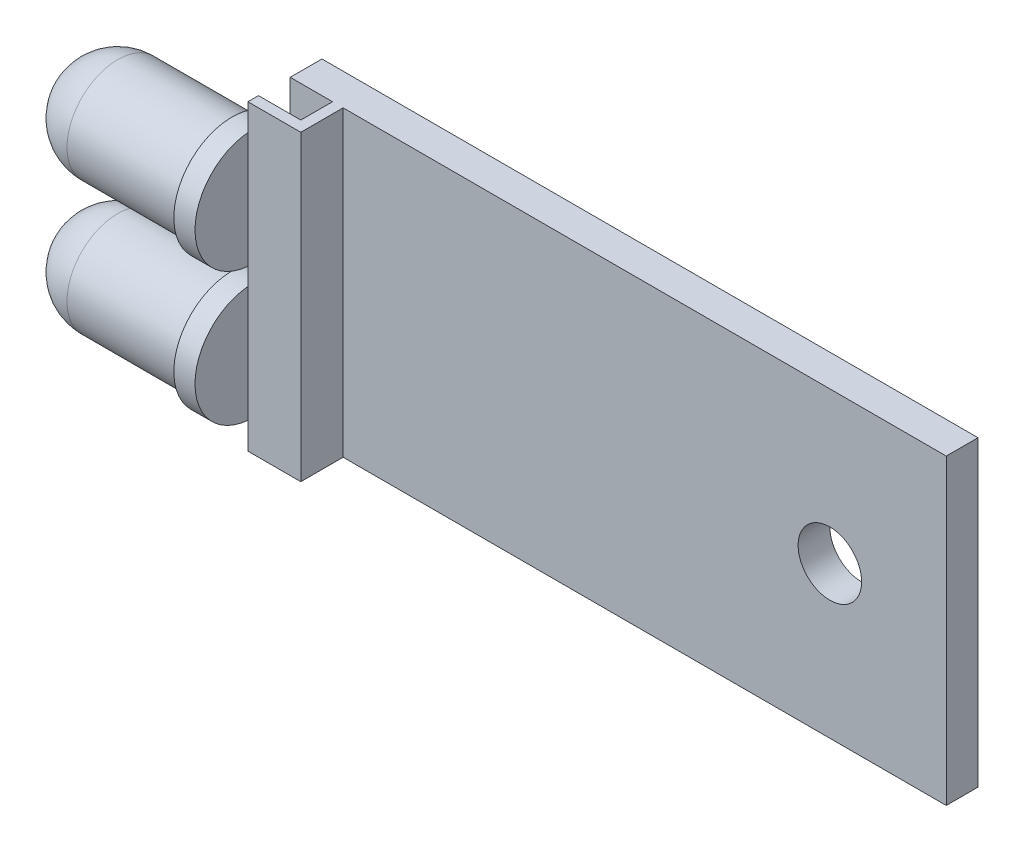
ISO-10303-21;
HEADER;
FILE_DESCRIPTION(('STEP AP214'),'2;1');
FILE_NAME('part.step','',(''),(''),'','','');
FILE_SCHEMA(('AUTOMOTIVE_DESIGN { 1 0 10303 214 1 1 1 1 }'));
ENDSEC;
DATA;
#1=APPLICATION_CONTEXT('core data for automotive mechanical design processes');
#2=APPLICATION_PROTOCOL_DEFINITION('international standard','automotive_design',2000,#1);
#3=PRODUCT_CONTEXT('',#1,'mechanical');
#4=PRODUCT('Part','Part','',(#3));
#5=PRODUCT_RELATED_PRODUCT_CATEGORY('part','',(#4));
#6=PRODUCT_DEFINITION_FORMATION('','',#4);
#7=PRODUCT_DEFINITION_CONTEXT('part definition',#1,'design');
#8=PRODUCT_DEFINITION('design','',#6,#7);
#9=PRODUCT_DEFINITION_SHAPE('','',#8);
#10=(LENGTH_UNIT() NAMED_UNIT(*) SI_UNIT(.MILLI.,.METRE.));
#11=(NAMED_UNIT(*) PLANE_ANGLE_UNIT() SI_UNIT($,.RADIAN.));
#12=(NAMED_UNIT(*) SI_UNIT($,.STERADIAN.) SOLID_ANGLE_UNIT());
#13=UNCERTAINTY_MEASURE_WITH_UNIT(LENGTH_MEASURE(1.E-05),#10,'distance_accuracy_value','');
#14=(GEOMETRIC_REPRESENTATION_CONTEXT(3) GLOBAL_UNCERTAINTY_ASSIGNED_CONTEXT((#13)) GLOBAL_UNIT_ASSIGNED_CONTEXT((#10,
#11,#12)) REPRESENTATION_CONTEXT('',''));
#15=CARTESIAN_POINT('',(0.,0.,0.));
#16=DIRECTION('',(0.,0.,1.));
#17=DIRECTION('',(1.,0.,0.));
#18=AXIS2_PLACEMENT_3D('',#15,#16,#17);
#19=CARTESIAN_POINT('',(0.,7.15,3.));
#20=DIRECTION('',(-1.,0.,0.));
#21=DIRECTION('',(0.,0.,1.));
#22=AXIS2_PLACEMENT_3D('',#19,#20,#21);
#23=PLANE('',#22);
#24=CARTESIAN_POINT('',(0.,3.15,3.25));
#25=DIRECTION('',(-1.,0.,0.));
#26=DIRECTION('',(0.,0.,-1.));
#27=AXIS2_PLACEMENT_3D('',#24,#25,#26);
#28=CIRCLE('',#27,2.75);
#29=CARTESIAN_POINT('',(0.,5.88861278752583,3.5));
#30=VERTEX_POINT('',#29);
#31=CARTESIAN_POINT('',(0.,5.88861278752583,3.));
#32=VERTEX_POINT('',#31);
#33=EDGE_CURVE('E345',#30,#32,#28,.T.);
#34=ORIENTED_EDGE('',*,*,#33,.F.);
#35=DIRECTION('',(0.,-1.,0.));
#36=VECTOR('',#35,1.);
#37=CARTESIAN_POINT('',(0.,7.15,3.5));
#38=LINE('',#37,#36);
#39=CARTESIAN_POINT('',(0.,7.15,3.5));
#40=VERTEX_POINT('',#39);
#41=EDGE_CURVE('E263',#40,#30,#38,.T.);
#42=ORIENTED_EDGE('',*,*,#41,.F.);
#43=DIRECTION('',(0.,0.,-1.));
#44=VECTOR('',#43,1.);
#45=CARTESIAN_POINT('',(0.,7.15,3.));
#46=LINE('',#45,#44);
#47=CARTESIAN_POINT('',(0.,7.15,3.));
#48=VERTEX_POINT('',#47);
#49=EDGE_CURVE('E220',#40,#48,#46,.T.);
#50=ORIENTED_EDGE('',*,*,#49,.T.);
#51=DIRECTION('',(0.,-1.,0.));
#52=VECTOR('',#51,1.);
#53=CARTESIAN_POINT('',(0.,7.15,3.));
#54=LINE('',#53,#52);
#55=EDGE_CURVE('E257',#48,#32,#54,.T.);
#56=ORIENTED_EDGE('',*,*,#55,.T.);
#57=EDGE_LOOP('',(#34,#42,#50,#56));
#58=FACE_BOUND('',#57,.T.);
#59=ADVANCED_FACE('F36',(#58),#23,.T.);
#60=CARTESIAN_POINT('',(0.,0.411387212474167,3.));
#61=VERTEX_POINT('',#60);
#62=CARTESIAN_POINT('',(0.,0.411387212474167,3.5));
#63=VERTEX_POINT('',#62);
#64=EDGE_CURVE('E59',#61,#63,#28,.T.);
#65=ORIENTED_EDGE('',*,*,#64,.F.);
#66=CARTESIAN_POINT('',(0.,-0.411387212474167,3.));
#67=VERTEX_POINT('',#66);
#68=EDGE_CURVE('E261',#61,#67,#54,.T.);
#69=ORIENTED_EDGE('',*,*,#68,.T.);
#70=CARTESIAN_POINT('',(0.,-3.15,3.25));
#71=DIRECTION('',(1.,0.,0.));
#72=DIRECTION('',(0.,0.,-1.));
#73=AXIS2_PLACEMENT_3D('',#70,#71,#72);
#74=CIRCLE('',#73,2.75);
#75=CARTESIAN_POINT('',(0.,-0.411387212474167,3.5));
#76=VERTEX_POINT('',#75);
#77=EDGE_CURVE('E204',#67,#76,#74,.T.);
#78=ORIENTED_EDGE('',*,*,#77,.T.);
#79=EDGE_CURVE('E268',#63,#76,#38,.T.);
#80=ORIENTED_EDGE('',*,*,#79,.F.);
#81=EDGE_LOOP('',(#65,#69,#78,#80));
#82=FACE_BOUND('',#81,.T.);
#83=ADVANCED_FACE('F373',(#82),#23,.T.);
#84=CARTESIAN_POINT('',(0.,0.,1.5));
#85=DIRECTION('',(0.,0.,-1.));
#86=DIRECTION('',(-1.,0.,0.));
#87=AXIS2_PLACEMENT_3D('',#84,#85,#86);
#88=PLANE('',#87);
#89=DIRECTION('',(0.,-1.,0.));
#90=VECTOR('',#89,1.);
#91=CARTESIAN_POINT('',(2.,7.15,1.5));
#92=LINE('',#91,#90);
#93=CARTESIAN_POINT('',(2.,7.15,1.5));
#94=VERTEX_POINT('',#93);
#95=CARTESIAN_POINT('',(2.,-7.15,1.5));
#96=VERTEX_POINT('',#95);
#97=EDGE_CURVE('E250',#94,#96,#92,.T.);
#98=ORIENTED_EDGE('',*,*,#97,.F.);
#99=DIRECTION('',(-1.,0.,0.));
#100=VECTOR('',#99,1.);
#101=CARTESIAN_POINT('',(0.,7.15,1.5));
#102=LINE('',#101,#100);
#103=CARTESIAN_POINT('',(0.,7.15,1.5));
#104=VERTEX_POINT('',#103);
#105=EDGE_CURVE('E286',#94,#104,#102,.T.);
#106=ORIENTED_EDGE('',*,*,#105,.T.);
#107=DIRECTION('',(0.,-1.,0.));
#108=VECTOR('',#107,1.);
#109=CARTESIAN_POINT('',(0.,-7.15,1.5));
#110=LINE('',#109,#108);
#111=CARTESIAN_POINT('',(0.,5.27132034355964,1.5));
#112=VERTEX_POINT('',#111);
#113=EDGE_CURVE('E175',#104,#112,#110,.T.);
#114=ORIENTED_EDGE('',*,*,#113,.T.);
#115=DIRECTION('',(0.,-1.,0.));
#116=VECTOR('',#115,1.);
#117=CARTESIAN_POINT('',(0.,0.,1.5));
#118=LINE('',#117,#116);
#119=CARTESIAN_POINT('',(0.,1.02867965644035,1.5));
#120=VERTEX_POINT('',#119);
#121=EDGE_CURVE('E163',#112,#120,#118,.T.);
#122=ORIENTED_EDGE('',*,*,#121,.T.);
#123=CARTESIAN_POINT('',(0.,-1.02867965644035,1.5));
#124=VERTEX_POINT('',#123);
#125=EDGE_CURVE('E168',#120,#124,#110,.T.);
#126=ORIENTED_EDGE('',*,*,#125,.T.);
#127=DIRECTION('',(0.,-1.,0.));
#128=VECTOR('',#127,1.);
#129=CARTESIAN_POINT('',(0.,0.,1.5));
#130=LINE('',#129,#128);
#131=CARTESIAN_POINT('',(0.,-5.27132034355964,1.5));
#132=VERTEX_POINT('',#131);
#133=EDGE_CURVE('E207',#124,#132,#130,.T.);
#134=ORIENTED_EDGE('',*,*,#133,.T.);
#135=CARTESIAN_POINT('',(0.,-7.15,1.5));
#136=VERTEX_POINT('',#135);
#137=EDGE_CURVE('E176',#132,#136,#110,.T.);
#138=ORIENTED_EDGE('',*,*,#137,.T.);
#139=DIRECTION('',(1.,0.,0.));
#140=VECTOR('',#139,1.);
#141=CARTESIAN_POINT('',(0.,-7.15,1.5));
#142=LINE('',#141,#140);
#143=EDGE_CURVE('E279',#136,#96,#142,.T.);
#144=ORIENTED_EDGE('',*,*,#143,.T.);
#145=EDGE_LOOP('',(#98,#106,#114,#122,#126,#134,#138,#144));
#146=FACE_BOUND('',#145,.T.);
#147=ADVANCED_FACE('F179',(#146),#88,.F.);
#148=CARTESIAN_POINT('',(0.,-7.15,1.5));
#149=DIRECTION('',(1.,0.,0.));
#150=DIRECTION('',(0.,1.,0.));
#151=AXIS2_PLACEMENT_3D('',#148,#149,#150);
#152=PLANE('',#151);
#153=ORIENTED_EDGE('',*,*,#125,.F.);
#154=EDGE_CURVE('E149',#112,#120,#28,.T.);
#155=ORIENTED_EDGE('',*,*,#154,.F.);
#156=ORIENTED_EDGE('',*,*,#113,.F.);
#157=DIRECTION('',(0.,0.,-1.));
#158=VECTOR('',#157,1.);
#159=CARTESIAN_POINT('',(0.,7.15,1.5));
#160=LINE('',#159,#158);
#161=CARTESIAN_POINT('',(0.,7.15,0.));
#162=VERTEX_POINT('',#161);
#163=EDGE_CURVE('E291',#104,#162,#160,.T.);
#164=ORIENTED_EDGE('',*,*,#163,.T.);
#165=DIRECTION('',(0.,-1.,0.));
#166=VECTOR('',#165,1.);
#167=CARTESIAN_POINT('',(0.,-7.15,0.));
#168=LINE('',#167,#166);
#169=CARTESIAN_POINT('',(0.,-7.15,0.));
#170=VERTEX_POINT('',#169);
#171=EDGE_CURVE('E253',#162,#170,#168,.T.);
#172=ORIENTED_EDGE('',*,*,#171,.T.);
#173=DIRECTION('',(0.,0.,-1.));
#174=VECTOR('',#173,1.);
#175=CARTESIAN_POINT('',(0.,-7.15,1.5));
#176=LINE('',#175,#174);
#177=EDGE_CURVE('E11',#136,#170,#176,.T.);
#178=ORIENTED_EDGE('',*,*,#177,.F.);
#179=ORIENTED_EDGE('',*,*,#137,.F.);
#180=EDGE_CURVE('E170',#132,#124,#74,.T.);
#181=ORIENTED_EDGE('',*,*,#180,.T.);
#182=EDGE_LOOP('',(#153,#155,#156,#164,#172,#178,#179,#181));
#183=FACE_BOUND('',#182,.T.);
#184=ADVANCED_FACE('F38',(#183),#152,.F.);
#185=CARTESIAN_POINT('',(0.,-7.15,1.5));
#186=DIRECTION('',(0.,1.,0.));
#187=DIRECTION('',(-1.,0.,0.));
#188=AXIS2_PLACEMENT_3D('',#185,#186,#187);
#189=PLANE('',#188);
#190=DIRECTION('',(1.,0.,0.));
#191=VECTOR('',#190,1.);
#192=CARTESIAN_POINT('',(0.,-7.15,0.));
#193=LINE('',#192,#191);
#194=CARTESIAN_POINT('',(31.,-7.15,0.));
#195=VERTEX_POINT('',#194);
#196=EDGE_CURVE('E295',#170,#195,#193,.T.);
#197=ORIENTED_EDGE('',*,*,#196,.T.);
#198=DIRECTION('',(0.,0.,-1.));
#199=VECTOR('',#198,1.);
#200=CARTESIAN_POINT('',(31.,-7.15,1.5));
#201=LINE('',#200,#199);
#202=CARTESIAN_POINT('',(31.,-7.15,1.5));
#203=VERTEX_POINT('',#202);
#204=EDGE_CURVE('E45',#203,#195,#201,.T.);
#205=ORIENTED_EDGE('',*,*,#204,.F.);
#206=CARTESIAN_POINT('',(2.5,-7.15,1.5));
#207=VERTEX_POINT('',#206);
#208=EDGE_CURVE('E278',#207,#203,#142,.T.);
#209=ORIENTED_EDGE('',*,*,#208,.F.);
#210=DIRECTION('',(0.,0.,1.));
#211=VECTOR('',#210,1.);
#212=CARTESIAN_POINT('',(2.5,-7.15,1.5));
#213=LINE('',#212,#211);
#214=CARTESIAN_POINT('',(2.5,-7.15,3.5));
#215=VERTEX_POINT('',#214);
#216=EDGE_CURVE('E210',#207,#215,#213,.T.);
#217=ORIENTED_EDGE('',*,*,#216,.T.);
#218=DIRECTION('',(-1.,0.,0.));
#219=VECTOR('',#218,1.);
#220=CARTESIAN_POINT('',(2.5,-7.15,3.5));
#221=LINE('',#220,#219);
#222=CARTESIAN_POINT('',(0.,-7.15,3.5));
#223=VERTEX_POINT('',#222);
#224=EDGE_CURVE('E235',#215,#223,#221,.T.);
#225=ORIENTED_EDGE('',*,*,#224,.T.);
#226=DIRECTION('',(0.,0.,-1.));
#227=VECTOR('',#226,1.);
#228=CARTESIAN_POINT('',(0.,-7.15,3.));
#229=LINE('',#228,#227);
#230=CARTESIAN_POINT('',(0.,-7.15,3.));
#231=VERTEX_POINT('',#230);
#232=EDGE_CURVE('E239',#223,#231,#229,.T.);
#233=ORIENTED_EDGE('',*,*,#232,.T.);
#234=DIRECTION('',(1.,0.,0.));
#235=VECTOR('',#234,1.);
#236=CARTESIAN_POINT('',(2.,-7.15,3.));
#237=LINE('',#236,#235);
#238=CARTESIAN_POINT('',(2.,-7.15,3.));
#239=VERTEX_POINT('',#238);
#240=EDGE_CURVE('E243',#231,#239,#237,.T.);
#241=ORIENTED_EDGE('',*,*,#240,.T.);
#242=DIRECTION('',(0.,0.,-1.));
#243=VECTOR('',#242,1.);
#244=CARTESIAN_POINT('',(2.,-7.15,1.5));
#245=LINE('',#244,#243);
#246=EDGE_CURVE('E216',#239,#96,#245,.T.);
#247=ORIENTED_EDGE('',*,*,#246,.T.);
#248=ORIENTED_EDGE('',*,*,#143,.F.);
#249=ORIENTED_EDGE('',*,*,#177,.T.);
#250=EDGE_LOOP('',(#197,#205,#209,#217,#225,#233,#241,#247,#248,#249));
#251=FACE_BOUND('',#250,.T.);
#252=ADVANCED_FACE('F330',(#251),#189,.F.);
#253=CARTESIAN_POINT('',(31.,-7.15,1.5));
#254=DIRECTION('',(-1.,0.,0.));
#255=DIRECTION('',(0.,0.,1.));
#256=AXIS2_PLACEMENT_3D('',#253,#254,#255);
#257=PLANE('',#256);
#258=DIRECTION('',(0.,1.,0.));
#259=VECTOR('',#258,1.);
#260=CARTESIAN_POINT('',(31.,-7.15,0.));
#261=LINE('',#260,#259);
#262=CARTESIAN_POINT('',(31.,7.15,0.));
#263=VERTEX_POINT('',#262);
#264=EDGE_CURVE('E298',#195,#263,#261,.T.);
#265=ORIENTED_EDGE('',*,*,#264,.T.);
#266=DIRECTION('',(0.,0.,-1.));
#267=VECTOR('',#266,1.);
#268=CARTESIAN_POINT('',(31.,7.15,1.5));
#269=LINE('',#268,#267);
#270=CARTESIAN_POINT('',(31.,7.15,1.5));
#271=VERTEX_POINT('',#270);
#272=EDGE_CURVE('E306',#271,#263,#269,.T.);
#273=ORIENTED_EDGE('',*,*,#272,.F.);
#274=DIRECTION('',(0.,1.,0.));
#275=VECTOR('',#274,1.);
#276=CARTESIAN_POINT('',(31.,-7.15,1.5));
#277=LINE('',#276,#275);
#278=EDGE_CURVE('E283',#203,#271,#277,.T.);
#279=ORIENTED_EDGE('',*,*,#278,.F.);
#280=ORIENTED_EDGE('',*,*,#204,.T.);
#281=EDGE_LOOP('',(#265,#273,#279,#280));
#282=FACE_BOUND('',#281,.T.);
#283=ADVANCED_FACE('F315',(#282),#257,.F.);
#284=CARTESIAN_POINT('',(0.,7.15,1.5));
#285=DIRECTION('',(0.,-1.,0.));
#286=DIRECTION('',(1.,0.,0.));
#287=AXIS2_PLACEMENT_3D('',#284,#285,#286);
#288=PLANE('',#287);
#289=DIRECTION('',(-1.,0.,0.));
#290=VECTOR('',#289,1.);
#291=CARTESIAN_POINT('',(0.,7.15,0.));
#292=LINE('',#291,#290);
#293=EDGE_CURVE('E300',#263,#162,#292,.T.);
#294=ORIENTED_EDGE('',*,*,#293,.T.);
#295=ORIENTED_EDGE('',*,*,#163,.F.);
#296=ORIENTED_EDGE('',*,*,#105,.F.);
#297=DIRECTION('',(0.,0.,-1.));
#298=VECTOR('',#297,1.);
#299=CARTESIAN_POINT('',(2.,7.15,1.5));
#300=LINE('',#299,#298);
#301=CARTESIAN_POINT('',(2.,7.15,3.));
#302=VERTEX_POINT('',#301);
#303=EDGE_CURVE('E228',#302,#94,#300,.T.);
#304=ORIENTED_EDGE('',*,*,#303,.F.);
#305=DIRECTION('',(1.,0.,0.));
#306=VECTOR('',#305,1.);
#307=CARTESIAN_POINT('',(2.,7.15,3.));
#308=LINE('',#307,#306);
#309=EDGE_CURVE('E224',#48,#302,#308,.T.);
#310=ORIENTED_EDGE('',*,*,#309,.F.);
#311=ORIENTED_EDGE('',*,*,#49,.F.);
#312=DIRECTION('',(-1.,0.,0.));
#313=VECTOR('',#312,1.);
#314=CARTESIAN_POINT('',(2.5,7.15,3.5));
#315=LINE('',#314,#313);
#316=CARTESIAN_POINT('',(2.5,7.15,3.5));
#317=VERTEX_POINT('',#316);
#318=EDGE_CURVE('E215',#317,#40,#315,.T.);
#319=ORIENTED_EDGE('',*,*,#318,.F.);
#320=DIRECTION('',(0.,0.,1.));
#321=VECTOR('',#320,1.);
#322=CARTESIAN_POINT('',(2.5,7.15,1.5));
#323=LINE('',#322,#321);
#324=CARTESIAN_POINT('',(2.5,7.15,1.5));
#325=VERTEX_POINT('',#324);
#326=EDGE_CURVE('E211',#325,#317,#323,.T.);
#327=ORIENTED_EDGE('',*,*,#326,.F.);
#328=EDGE_CURVE('E287',#271,#325,#102,.T.);
#329=ORIENTED_EDGE('',*,*,#328,.F.);
#330=ORIENTED_EDGE('',*,*,#272,.T.);
#331=EDGE_LOOP('',(#294,#295,#296,#304,#310,#311,#319,#327,#329,#330));
#332=FACE_BOUND('',#331,.T.);
#333=ADVANCED_FACE('F325',(#332),#288,.F.);
#334=CARTESIAN_POINT('',(25.5,0.,1.5));
#335=DIRECTION('',(0.,0.,1.));
#336=DIRECTION('',(1.,0.,0.));
#337=AXIS2_PLACEMENT_3D('',#334,#335,#336);
#338=CIRCLE('',#337,1.5);
#339=CARTESIAN_POINT('',(27.,0.,1.5));
#340=VERTEX_POINT('',#339);
#341=EDGE_CURVE('E390',#340,#340,#338,.T.);
#342=ORIENTED_EDGE('',*,*,#341,.F.);
#343=EDGE_LOOP('',(#342));
#344=FACE_BOUND('',#343,.T.);
#345=ORIENTED_EDGE('',*,*,#328,.T.);
#346=DIRECTION('',(0.,-1.,0.));
#347=VECTOR('',#346,1.);
#348=CARTESIAN_POINT('',(2.5,7.15,1.5));
#349=LINE('',#348,#347);
#350=EDGE_CURVE('E231',#325,#207,#349,.T.);
#351=ORIENTED_EDGE('',*,*,#350,.T.);
#352=ORIENTED_EDGE('',*,*,#208,.T.);
#353=ORIENTED_EDGE('',*,*,#278,.T.);
#354=EDGE_LOOP('',(#345,#351,#352,#353));
#355=FACE_BOUND('',#354,.T.);
#356=ADVANCED_FACE('F434',(#344,#355),#88,.F.);
#357=CARTESIAN_POINT('',(0.,0.,0.));
#358=DIRECTION('',(0.,0.,-1.));
#359=DIRECTION('',(-1.,0.,0.));
#360=AXIS2_PLACEMENT_3D('',#357,#358,#359);
#361=PLANE('',#360);
#362=CARTESIAN_POINT('',(25.5,0.,0.));
#363=DIRECTION('',(0.,0.,1.));
#364=DIRECTION('',(1.,0.,0.));
#365=AXIS2_PLACEMENT_3D('',#362,#363,#364);
#366=CIRCLE('',#365,1.5);
#367=CARTESIAN_POINT('',(27.,0.,0.));
#368=VERTEX_POINT('',#367);
#369=EDGE_CURVE('E388',#368,#368,#366,.T.);
#370=ORIENTED_EDGE('',*,*,#369,.T.);
#371=EDGE_LOOP('',(#370));
#372=FACE_BOUND('',#371,.T.);
#373=ORIENTED_EDGE('',*,*,#171,.F.);
#374=ORIENTED_EDGE('',*,*,#293,.F.);
#375=ORIENTED_EDGE('',*,*,#264,.F.);
#376=ORIENTED_EDGE('',*,*,#196,.F.);
#377=EDGE_LOOP('',(#373,#374,#375,#376));
#378=FACE_BOUND('',#377,.T.);
#379=ADVANCED_FACE('F322',(#372,#378),#361,.T.);
#380=CARTESIAN_POINT('',(2.,7.15,1.5));
#381=DIRECTION('',(-1.,0.,0.));
#382=DIRECTION('',(0.,0.,1.));
#383=AXIS2_PLACEMENT_3D('',#380,#381,#382);
#384=PLANE('',#383);
#385=ORIENTED_EDGE('',*,*,#246,.F.);
#386=DIRECTION('',(0.,-1.,0.));
#387=VECTOR('',#386,1.);
#388=CARTESIAN_POINT('',(2.,7.15,3.));
#389=LINE('',#388,#387);
#390=EDGE_CURVE('E254',#302,#239,#389,.T.);
#391=ORIENTED_EDGE('',*,*,#390,.F.);
#392=ORIENTED_EDGE('',*,*,#303,.T.);
#393=ORIENTED_EDGE('',*,*,#97,.T.);
#394=EDGE_LOOP('',(#385,#391,#392,#393));
#395=FACE_BOUND('',#394,.T.);
#396=ADVANCED_FACE('F426',(#395),#384,.T.);
#397=CARTESIAN_POINT('',(2.,7.15,3.));
#398=DIRECTION('',(0.,0.,-1.));
#399=DIRECTION('',(-1.,0.,0.));
#400=AXIS2_PLACEMENT_3D('',#397,#398,#399);
#401=PLANE('',#400);
#402=ORIENTED_EDGE('',*,*,#240,.F.);
#403=CARTESIAN_POINT('',(0.,-5.88861278752583,3.));
#404=VERTEX_POINT('',#403);
#405=EDGE_CURVE('E262',#404,#231,#54,.T.);
#406=ORIENTED_EDGE('',*,*,#405,.F.);
#407=DIRECTION('',(0.,-1.,0.));
#408=VECTOR('',#407,1.);
#409=CARTESIAN_POINT('',(0.,7.15,3.));
#410=LINE('',#409,#408);
#411=EDGE_CURVE('E203',#67,#404,#410,.T.);
#412=ORIENTED_EDGE('',*,*,#411,.F.);
#413=ORIENTED_EDGE('',*,*,#68,.F.);
#414=DIRECTION('',(0.,-1.,0.));
#415=VECTOR('',#414,1.);
#416=CARTESIAN_POINT('',(0.,7.15,3.));
#417=LINE('',#416,#415);
#418=EDGE_CURVE('E165',#32,#61,#417,.T.);
#419=ORIENTED_EDGE('',*,*,#418,.F.);
#420=ORIENTED_EDGE('',*,*,#55,.F.);
#421=ORIENTED_EDGE('',*,*,#309,.T.);
#422=ORIENTED_EDGE('',*,*,#390,.T.);
#423=EDGE_LOOP('',(#402,#406,#412,#413,#419,#420,#421,#422));
#424=FACE_BOUND('',#423,.T.);
#425=ADVANCED_FACE('F383',(#424),#401,.T.);
#426=CARTESIAN_POINT('',(0.,-5.88861278752583,3.5));
#427=VERTEX_POINT('',#426);
#428=EDGE_CURVE('E343',#427,#404,#74,.T.);
#429=ORIENTED_EDGE('',*,*,#428,.T.);
#430=ORIENTED_EDGE('',*,*,#405,.T.);
#431=ORIENTED_EDGE('',*,*,#232,.F.);
#432=EDGE_CURVE('E273',#427,#223,#38,.T.);
#433=ORIENTED_EDGE('',*,*,#432,.F.);
#434=EDGE_LOOP('',(#429,#430,#431,#433));
#435=FACE_BOUND('',#434,.T.);
#436=ADVANCED_FACE('F414',(#435),#23,.T.);
#437=CARTESIAN_POINT('',(2.5,7.15,3.5));
#438=DIRECTION('',(0.,0.,1.));
#439=DIRECTION('',(1.,0.,0.));
#440=AXIS2_PLACEMENT_3D('',#437,#438,#439);
#441=PLANE('',#440);
#442=ORIENTED_EDGE('',*,*,#224,.F.);
#443=DIRECTION('',(0.,-1.,0.));
#444=VECTOR('',#443,1.);
#445=CARTESIAN_POINT('',(2.5,7.15,3.5));
#446=LINE('',#445,#444);
#447=EDGE_CURVE('E270',#317,#215,#446,.T.);
#448=ORIENTED_EDGE('',*,*,#447,.F.);
#449=ORIENTED_EDGE('',*,*,#318,.T.);
#450=ORIENTED_EDGE('',*,*,#41,.T.);
#451=EDGE_CURVE('E267',#30,#63,#38,.T.);
#452=ORIENTED_EDGE('',*,*,#451,.T.);
#453=ORIENTED_EDGE('',*,*,#79,.T.);
#454=EDGE_CURVE('E269',#76,#427,#38,.T.);
#455=ORIENTED_EDGE('',*,*,#454,.T.);
#456=ORIENTED_EDGE('',*,*,#432,.T.);
#457=EDGE_LOOP('',(#442,#448,#449,#450,#452,#453,#455,#456));
#458=FACE_BOUND('',#457,.T.);
#459=ADVANCED_FACE('F398',(#458),#441,.T.);
#460=CARTESIAN_POINT('',(2.5,7.15,1.5));
#461=DIRECTION('',(1.,0.,0.));
#462=DIRECTION('',(0.,0.,-1.));
#463=AXIS2_PLACEMENT_3D('',#460,#461,#462);
#464=PLANE('',#463);
#465=ORIENTED_EDGE('',*,*,#216,.F.);
#466=ORIENTED_EDGE('',*,*,#350,.F.);
#467=ORIENTED_EDGE('',*,*,#326,.T.);
#468=ORIENTED_EDGE('',*,*,#447,.T.);
#469=EDGE_LOOP('',(#465,#466,#467,#468));
#470=FACE_BOUND('',#469,.T.);
#471=ADVANCED_FACE('F409',(#470),#464,.T.);
#472=CARTESIAN_POINT('',(0.,-3.15,3.5));
#473=DIRECTION('',(1.,0.,0.));
#474=DIRECTION('',(0.,0.,-1.));
#475=AXIS2_PLACEMENT_3D('',#472,#473,#474);
#476=PLANE('',#475);
#477=ORIENTED_EDGE('',*,*,#133,.F.);
#478=EDGE_CURVE('E199',#124,#67,#74,.T.);
#479=ORIENTED_EDGE('',*,*,#478,.T.);
#480=ORIENTED_EDGE('',*,*,#411,.T.);
#481=EDGE_CURVE('E341',#404,#132,#74,.T.);
#482=ORIENTED_EDGE('',*,*,#481,.T.);
#483=EDGE_LOOP('',(#477,#479,#480,#482));
#484=FACE_BOUND('',#483,.T.);
#485=ADVANCED_FACE('F379',(#484),#476,.T.);
#486=EDGE_CURVE('E358',#76,#427,#74,.T.);
#487=ORIENTED_EDGE('',*,*,#486,.T.);
#488=ORIENTED_EDGE('',*,*,#454,.F.);
#489=EDGE_LOOP('',(#487,#488));
#490=FACE_BOUND('',#489,.T.);
#491=ADVANCED_FACE('F399',(#490),#476,.T.);
#492=CARTESIAN_POINT('',(0.,-3.15,3.25));
#493=DIRECTION('',(1.,0.,0.));
#494=DIRECTION('',(0.,0.,-1.));
#495=AXIS2_PLACEMENT_3D('',#492,#493,#494);
#496=CYLINDRICAL_SURFACE('',#495,2.75);
#497=CARTESIAN_POINT('',(-1.,-3.15,3.25));
#498=DIRECTION('',(1.,0.,0.));
#499=DIRECTION('',(0.,0.,-1.));
#500=AXIS2_PLACEMENT_3D('',#497,#498,#499);
#501=CIRCLE('',#500,2.75);
#502=CARTESIAN_POINT('',(-1.,-3.15,0.5));
#503=VERTEX_POINT('',#502);
#504=EDGE_CURVE('E195',#503,#503,#501,.T.);
#505=ORIENTED_EDGE('',*,*,#504,.T.);
#506=EDGE_LOOP('',(#505));
#507=FACE_BOUND('',#506,.T.);
#508=ORIENTED_EDGE('',*,*,#478,.F.);
#509=ORIENTED_EDGE('',*,*,#180,.F.);
#510=ORIENTED_EDGE('',*,*,#481,.F.);
#511=ORIENTED_EDGE('',*,*,#428,.F.);
#512=ORIENTED_EDGE('',*,*,#486,.F.);
#513=ORIENTED_EDGE('',*,*,#77,.F.);
#514=EDGE_LOOP('',(#508,#509,#510,#511,#512,#513));
#515=FACE_BOUND('',#514,.T.);
#516=ADVANCED_FACE('F376',(#507,#515),#496,.T.);
#517=CARTESIAN_POINT('',(-1.,-3.15,6.));
#518=DIRECTION('',(-1.,0.,0.));
#519=DIRECTION('',(0.,0.,1.));
#520=AXIS2_PLACEMENT_3D('',#517,#518,#519);
#521=PLANE('',#520);
#522=CARTESIAN_POINT('',(-1.,-3.15,3.25));
#523=DIRECTION('',(1.,0.,0.));
#524=DIRECTION('',(0.,0.,-1.));
#525=AXIS2_PLACEMENT_3D('',#522,#523,#524);
#526=CIRCLE('',#525,2.4);
#527=CARTESIAN_POINT('',(-1.,-3.15,0.85));
#528=VERTEX_POINT('',#527);
#529=EDGE_CURVE('E187',#528,#528,#526,.T.);
#530=ORIENTED_EDGE('',*,*,#529,.T.);
#531=EDGE_LOOP('',(#530));
#532=FACE_BOUND('',#531,.T.);
#533=ORIENTED_EDGE('',*,*,#504,.F.);
#534=EDGE_LOOP('',(#533));
#535=FACE_BOUND('',#534,.T.);
#536=ADVANCED_FACE('F406',(#532,#535),#521,.T.);
#537=CARTESIAN_POINT('',(0.,-3.15,3.25));
#538=DIRECTION('',(1.,0.,0.));
#539=DIRECTION('',(0.,0.,-1.));
#540=AXIS2_PLACEMENT_3D('',#537,#538,#539);
#541=CYLINDRICAL_SURFACE('',#540,2.4);
#542=CARTESIAN_POINT('',(-6.4,-3.15,3.25));
#543=DIRECTION('',(1.,0.,0.));
#544=DIRECTION('',(0.,0.,-1.));
#545=AXIS2_PLACEMENT_3D('',#542,#543,#544);
#546=CIRCLE('',#545,2.4);
#547=CARTESIAN_POINT('',(-6.4,-3.15,0.850000000000001));
#548=VERTEX_POINT('',#547);
#549=EDGE_CURVE('E181',#548,#548,#546,.T.);
#550=ORIENTED_EDGE('',*,*,#549,.T.);
#551=EDGE_LOOP('',(#550));
#552=FACE_BOUND('',#551,.T.);
#553=ORIENTED_EDGE('',*,*,#529,.F.);
#554=EDGE_LOOP('',(#553));
#555=FACE_BOUND('',#554,.T.);
#556=ADVANCED_FACE('F472',(#552,#555),#541,.T.);
#557=CARTESIAN_POINT('',(-6.4,-3.15,3.25));
#558=DIRECTION('',(1.,0.,0.));
#559=DIRECTION('',(0.,0.,1.));
#560=AXIS2_PLACEMENT_3D('',#557,#558,#559);
#561=SPHERICAL_SURFACE('',#560,2.4);
#562=ORIENTED_EDGE('',*,*,#549,.F.);
#563=EDGE_LOOP('',(#562));
#564=FACE_BOUND('',#563,.T.);
#565=ADVANCED_FACE('F469',(#564),#561,.T.);
#566=CARTESIAN_POINT('',(0.,3.15,3.5));
#567=DIRECTION('',(1.,0.,0.));
#568=DIRECTION('',(0.,0.,-1.));
#569=AXIS2_PLACEMENT_3D('',#566,#567,#568);
#570=PLANE('',#569);
#571=ORIENTED_EDGE('',*,*,#121,.F.);
#572=EDGE_CURVE('E52',#32,#112,#28,.T.);
#573=ORIENTED_EDGE('',*,*,#572,.F.);
#574=ORIENTED_EDGE('',*,*,#418,.T.);
#575=EDGE_CURVE('E152',#120,#61,#28,.T.);
#576=ORIENTED_EDGE('',*,*,#575,.F.);
#577=EDGE_LOOP('',(#571,#573,#574,#576));
#578=FACE_BOUND('',#577,.T.);
#579=ADVANCED_FACE('F161',(#578),#570,.T.);
#580=EDGE_CURVE('E347',#63,#30,#28,.T.);
#581=ORIENTED_EDGE('',*,*,#580,.F.);
#582=ORIENTED_EDGE('',*,*,#451,.F.);
#583=EDGE_LOOP('',(#581,#582));
#584=FACE_BOUND('',#583,.T.);
#585=ADVANCED_FACE('F461',(#584),#570,.T.);
#586=CARTESIAN_POINT('',(0.,3.15,3.25));
#587=DIRECTION('',(1.,0.,0.));
#588=DIRECTION('',(0.,0.,-1.));
#589=AXIS2_PLACEMENT_3D('',#586,#587,#588);
#590=CYLINDRICAL_SURFACE('',#589,2.75);
#591=CARTESIAN_POINT('',(-1.,3.15,3.25));
#592=DIRECTION('',(-1.,0.,0.));
#593=DIRECTION('',(0.,0.,-1.));
#594=AXIS2_PLACEMENT_3D('',#591,#592,#593);
#595=CIRCLE('',#594,2.75);
#596=CARTESIAN_POINT('',(-1.,3.15,0.5));
#597=VERTEX_POINT('',#596);
#598=EDGE_CURVE('E158',#597,#597,#595,.T.);
#599=ORIENTED_EDGE('',*,*,#598,.F.);
#600=EDGE_LOOP('',(#599));
#601=FACE_BOUND('',#600,.T.);
#602=ORIENTED_EDGE('',*,*,#575,.T.);
#603=ORIENTED_EDGE('',*,*,#64,.T.);
#604=ORIENTED_EDGE('',*,*,#580,.T.);
#605=ORIENTED_EDGE('',*,*,#33,.T.);
#606=ORIENTED_EDGE('',*,*,#572,.T.);
#607=ORIENTED_EDGE('',*,*,#154,.T.);
#608=EDGE_LOOP('',(#602,#603,#604,#605,#606,#607));
#609=FACE_BOUND('',#608,.T.);
#610=ADVANCED_FACE('F151',(#601,#609),#590,.T.);
#611=CARTESIAN_POINT('',(-1.,3.15,6.));
#612=DIRECTION('',(-1.,0.,0.));
#613=DIRECTION('',(0.,0.,1.));
#614=AXIS2_PLACEMENT_3D('',#611,#612,#613);
#615=PLANE('',#614);
#616=CARTESIAN_POINT('',(-1.,3.15,3.25));
#617=DIRECTION('',(-1.,0.,0.));
#618=DIRECTION('',(0.,0.,-1.));
#619=AXIS2_PLACEMENT_3D('',#616,#617,#618);
#620=CIRCLE('',#619,2.4);
#621=CARTESIAN_POINT('',(-1.,3.15,0.85));
#622=VERTEX_POINT('',#621);
#623=EDGE_CURVE('E337',#622,#622,#620,.T.);
#624=ORIENTED_EDGE('',*,*,#623,.F.);
#625=EDGE_LOOP('',(#624));
#626=FACE_BOUND('',#625,.T.);
#627=ORIENTED_EDGE('',*,*,#598,.T.);
#628=EDGE_LOOP('',(#627));
#629=FACE_BOUND('',#628,.T.);
#630=ADVANCED_FACE('F451',(#626,#629),#615,.T.);
#631=CARTESIAN_POINT('',(0.,3.15,3.25));
#632=DIRECTION('',(1.,0.,0.));
#633=DIRECTION('',(0.,0.,-1.));
#634=AXIS2_PLACEMENT_3D('',#631,#632,#633);
#635=CYLINDRICAL_SURFACE('',#634,2.4);
#636=CARTESIAN_POINT('',(-6.4,3.15,3.25));
#637=DIRECTION('',(-1.,0.,0.));
#638=DIRECTION('',(0.,0.,-1.));
#639=AXIS2_PLACEMENT_3D('',#636,#637,#638);
#640=CIRCLE('',#639,2.4);
#641=CARTESIAN_POINT('',(-6.4,3.15,0.850000000000001));
#642=VERTEX_POINT('',#641);
#643=EDGE_CURVE('E349',#642,#642,#640,.T.);
#644=ORIENTED_EDGE('',*,*,#643,.F.);
#645=EDGE_LOOP('',(#644));
#646=FACE_BOUND('',#645,.T.);
#647=ORIENTED_EDGE('',*,*,#623,.T.);
#648=EDGE_LOOP('',(#647));
#649=FACE_BOUND('',#648,.T.);
#650=ADVANCED_FACE('F448',(#646,#649),#635,.T.);
#651=CARTESIAN_POINT('',(-6.4,3.15,3.25));
#652=DIRECTION('',(1.,0.,0.));
#653=DIRECTION('',(0.,0.,1.));
#654=AXIS2_PLACEMENT_3D('',#651,#652,#653);
#655=SPHERICAL_SURFACE('',#654,2.4);
#656=ORIENTED_EDGE('',*,*,#643,.T.);
#657=EDGE_LOOP('',(#656));
#658=FACE_BOUND('',#657,.T.);
#659=ADVANCED_FACE('F446',(#658),#655,.T.);
#660=CARTESIAN_POINT('',(25.5,0.,0.));
#661=DIRECTION('',(0.,0.,1.));
#662=DIRECTION('',(1.,0.,0.));
#663=AXIS2_PLACEMENT_3D('',#660,#661,#662);
#664=CYLINDRICAL_SURFACE('',#663,1.5);
#665=ORIENTED_EDGE('',*,*,#369,.F.);
#666=EDGE_LOOP('',(#665));
#667=FACE_BOUND('',#666,.T.);
#668=ORIENTED_EDGE('',*,*,#341,.T.);
#669=EDGE_LOOP('',(#668));
#670=FACE_BOUND('',#669,.T.);
#671=ADVANCED_FACE('F520',(#667,#670),#664,.F.);
#672=CLOSED_SHELL('',(#59,#83,#147,#184,#252,#283,#333,#356,#379,#396,#425,#436,#459,#471,#485,
#491,#516,#536,#556,#565,#579,#585,#610,#630,#650,#659,#671));
#673=MANIFOLD_SOLID_BREP('B2',#672);
#674=ADVANCED_BREP_SHAPE_REPRESENTATION('',(#18,#673),#14);
#675=SHAPE_DEFINITION_REPRESENTATION(#9,#674);
ENDSEC;
END-ISO-10303-21;
